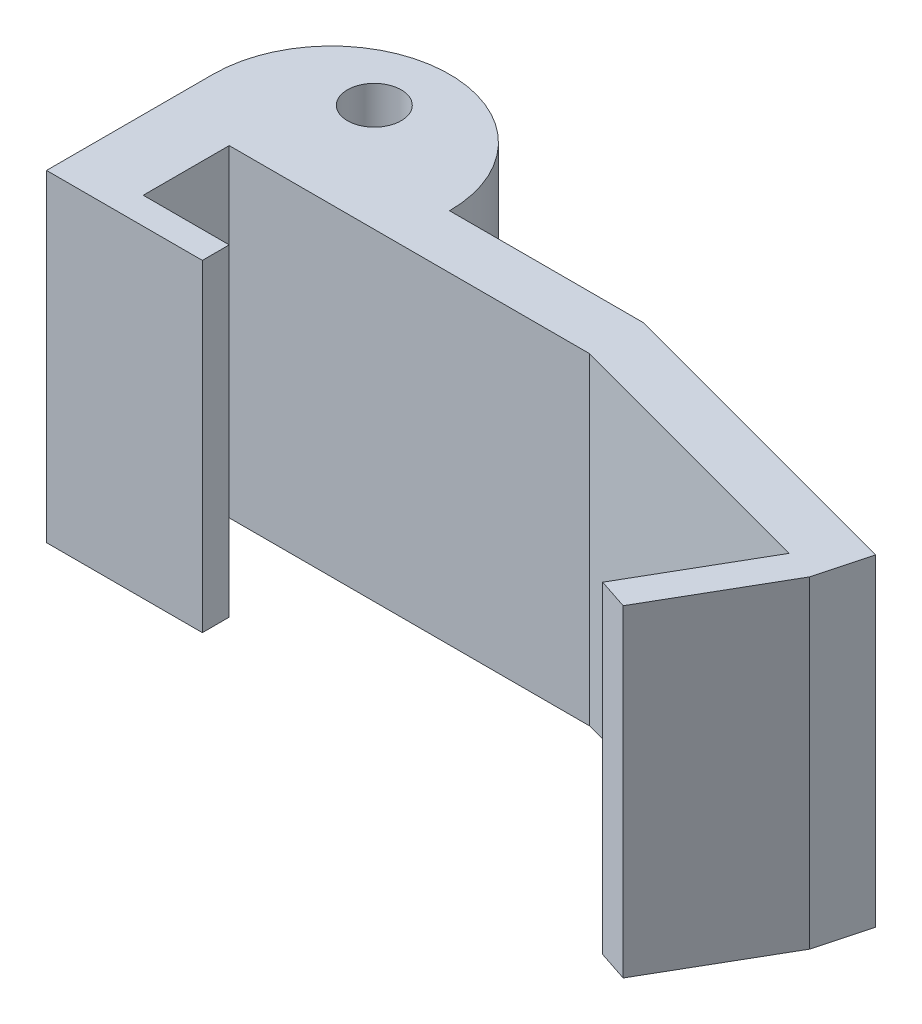
ISO-10303-21;
HEADER;
FILE_DESCRIPTION(('STEP AP214'),'2;1');
FILE_NAME('part.step','',(''),(''),'','','');
FILE_SCHEMA(('AUTOMOTIVE_DESIGN { 1 0 10303 214 1 1 1 1 }'));
ENDSEC;
DATA;
#1=APPLICATION_CONTEXT('core data for automotive mechanical design processes');
#2=APPLICATION_PROTOCOL_DEFINITION('international standard','automotive_design',2000,#1);
#3=PRODUCT_CONTEXT('',#1,'mechanical');
#4=PRODUCT('Part','Part','',(#3));
#5=PRODUCT_RELATED_PRODUCT_CATEGORY('part','',(#4));
#6=PRODUCT_DEFINITION_FORMATION('','',#4);
#7=PRODUCT_DEFINITION_CONTEXT('part definition',#1,'design');
#8=PRODUCT_DEFINITION('design','',#6,#7);
#9=PRODUCT_DEFINITION_SHAPE('','',#8);
#10=(LENGTH_UNIT() NAMED_UNIT(*) SI_UNIT(.MILLI.,.METRE.));
#11=(NAMED_UNIT(*) PLANE_ANGLE_UNIT() SI_UNIT($,.RADIAN.));
#12=(NAMED_UNIT(*) SI_UNIT($,.STERADIAN.) SOLID_ANGLE_UNIT());
#13=UNCERTAINTY_MEASURE_WITH_UNIT(LENGTH_MEASURE(1.E-05),#10,'distance_accuracy_value','');
#14=(GEOMETRIC_REPRESENTATION_CONTEXT(3) GLOBAL_UNCERTAINTY_ASSIGNED_CONTEXT((#13)) GLOBAL_UNIT_ASSIGNED_CONTEXT((#10,
#11,#12)) REPRESENTATION_CONTEXT('',''));
#15=CARTESIAN_POINT('',(0.,0.,0.));
#16=DIRECTION('',(0.,0.,1.));
#17=DIRECTION('',(1.,0.,0.));
#18=AXIS2_PLACEMENT_3D('',#15,#16,#17);
#19=CARTESIAN_POINT('',(2.,6.,-1.));
#20=DIRECTION('',(0.,-1.,0.));
#21=DIRECTION('',(0.,0.,-1.));
#22=AXIS2_PLACEMENT_3D('',#19,#20,#21);
#23=CYLINDRICAL_SURFACE('',#22,0.5);
#24=CARTESIAN_POINT('',(2.,6.,-1.));
#25=DIRECTION('',(0.,1.,0.));
#26=DIRECTION('',(0.,0.,1.));
#27=AXIS2_PLACEMENT_3D('',#24,#25,#26);
#28=CIRCLE('',#27,0.5);
#29=CARTESIAN_POINT('',(2.,6.,-0.5));
#30=VERTEX_POINT('',#29);
#31=EDGE_CURVE('E179',#30,#30,#28,.T.);
#32=ORIENTED_EDGE('',*,*,#31,.T.);
#33=EDGE_LOOP('',(#32));
#34=FACE_BOUND('',#33,.T.);
#35=CARTESIAN_POINT('',(2.,0.,-1.));
#36=DIRECTION('',(0.,1.,0.));
#37=DIRECTION('',(0.,0.,1.));
#38=AXIS2_PLACEMENT_3D('',#35,#36,#37);
#39=CIRCLE('',#38,0.5);
#40=CARTESIAN_POINT('',(2.,0.,-0.5));
#41=VERTEX_POINT('',#40);
#42=EDGE_CURVE('E180',#41,#41,#39,.T.);
#43=ORIENTED_EDGE('',*,*,#42,.F.);
#44=EDGE_LOOP('',(#43));
#45=FACE_BOUND('',#44,.T.);
#46=ADVANCED_FACE('F85',(#34,#45),#23,.F.);
#47=CARTESIAN_POINT('',(0.,6.,0.));
#48=DIRECTION('',(0.,0.,1.));
#49=DIRECTION('',(1.,0.,0.));
#50=AXIS2_PLACEMENT_3D('',#47,#48,#49);
#51=PLANE('',#50);
#52=DIRECTION('',(-1.,0.,0.));
#53=VECTOR('',#52,1.);
#54=CARTESIAN_POINT('',(0.,0.,0.));
#55=LINE('',#54,#53);
#56=CARTESIAN_POINT('',(8.,0.,0.));
#57=VERTEX_POINT('',#56);
#58=CARTESIAN_POINT('',(4.4,0.,0.));
#59=VERTEX_POINT('',#58);
#60=EDGE_CURVE('E210',#57,#59,#55,.T.);
#61=ORIENTED_EDGE('',*,*,#60,.T.);
#62=DIRECTION('',(0.,-1.,0.));
#63=VECTOR('',#62,1.);
#64=CARTESIAN_POINT('',(4.4,6.,0.));
#65=LINE('',#64,#63);
#66=CARTESIAN_POINT('',(4.4,6.,0.));
#67=VERTEX_POINT('',#66);
#68=EDGE_CURVE('E150',#67,#59,#65,.T.);
#69=ORIENTED_EDGE('',*,*,#68,.F.);
#70=DIRECTION('',(-1.,0.,0.));
#71=VECTOR('',#70,1.);
#72=CARTESIAN_POINT('',(0.,6.,0.));
#73=LINE('',#72,#71);
#74=CARTESIAN_POINT('',(8.,6.,0.));
#75=VERTEX_POINT('',#74);
#76=EDGE_CURVE('E246',#75,#67,#73,.T.);
#77=ORIENTED_EDGE('',*,*,#76,.F.);
#78=DIRECTION('',(0.,-1.,0.));
#79=VECTOR('',#78,1.);
#80=CARTESIAN_POINT('',(8.,6.,0.));
#81=LINE('',#80,#79);
#82=EDGE_CURVE('E95',#75,#57,#81,.T.);
#83=ORIENTED_EDGE('',*,*,#82,.T.);
#84=EDGE_LOOP('',(#61,#69,#77,#83));
#85=FACE_BOUND('',#84,.T.);
#86=ADVANCED_FACE('F329',(#85),#51,.F.);
#87=CARTESIAN_POINT('',(2.2,6.,0.));
#88=DIRECTION('',(0.,-1.,0.));
#89=DIRECTION('',(0.,0.,-1.));
#90=AXIS2_PLACEMENT_3D('',#87,#88,#89);
#91=CYLINDRICAL_SURFACE('',#90,2.2);
#92=CARTESIAN_POINT('',(2.2,0.,0.));
#93=DIRECTION('',(0.,1.,0.));
#94=DIRECTION('',(0.,0.,1.));
#95=AXIS2_PLACEMENT_3D('',#92,#93,#94);
#96=CIRCLE('',#95,2.2);
#97=CARTESIAN_POINT('',(0.,0.,0.));
#98=VERTEX_POINT('',#97);
#99=EDGE_CURVE('E207',#98,#59,#96,.F.);
#100=ORIENTED_EDGE('',*,*,#99,.F.);
#101=DIRECTION('',(0.,-1.,0.));
#102=VECTOR('',#101,1.);
#103=CARTESIAN_POINT('',(0.,6.,0.));
#104=LINE('',#103,#102);
#105=CARTESIAN_POINT('',(0.,6.,0.));
#106=VERTEX_POINT('',#105);
#107=EDGE_CURVE('E153',#106,#98,#104,.T.);
#108=ORIENTED_EDGE('',*,*,#107,.F.);
#109=CARTESIAN_POINT('',(2.2,6.,0.));
#110=DIRECTION('',(0.,1.,0.));
#111=DIRECTION('',(0.,0.,1.));
#112=AXIS2_PLACEMENT_3D('',#109,#110,#111);
#113=CIRCLE('',#112,2.2);
#114=EDGE_CURVE('E243',#106,#67,#113,.F.);
#115=ORIENTED_EDGE('',*,*,#114,.T.);
#116=ORIENTED_EDGE('',*,*,#68,.T.);
#117=EDGE_LOOP('',(#100,#108,#115,#116));
#118=FACE_BOUND('',#117,.T.);
#119=ADVANCED_FACE('F334',(#118),#91,.T.);
#120=CARTESIAN_POINT('',(0.,6.,0.));
#121=DIRECTION('',(1.,0.,0.));
#122=DIRECTION('',(0.,0.,-1.));
#123=AXIS2_PLACEMENT_3D('',#120,#121,#122);
#124=PLANE('',#123);
#125=DIRECTION('',(0.,0.,1.));
#126=VECTOR('',#125,1.);
#127=CARTESIAN_POINT('',(0.,0.,0.));
#128=LINE('',#127,#126);
#129=CARTESIAN_POINT('',(0.,0.,3.1));
#130=VERTEX_POINT('',#129);
#131=EDGE_CURVE('E204',#98,#130,#128,.T.);
#132=ORIENTED_EDGE('',*,*,#131,.T.);
#133=DIRECTION('',(0.,-1.,0.));
#134=VECTOR('',#133,1.);
#135=CARTESIAN_POINT('',(0.,6.,3.1));
#136=LINE('',#135,#134);
#137=CARTESIAN_POINT('',(0.,6.,3.1));
#138=VERTEX_POINT('',#137);
#139=EDGE_CURVE('E156',#138,#130,#136,.T.);
#140=ORIENTED_EDGE('',*,*,#139,.F.);
#141=DIRECTION('',(0.,0.,1.));
#142=VECTOR('',#141,1.);
#143=CARTESIAN_POINT('',(0.,6.,0.));
#144=LINE('',#143,#142);
#145=EDGE_CURVE('E240',#106,#138,#144,.T.);
#146=ORIENTED_EDGE('',*,*,#145,.F.);
#147=ORIENTED_EDGE('',*,*,#107,.T.);
#148=EDGE_LOOP('',(#132,#140,#146,#147));
#149=FACE_BOUND('',#148,.T.);
#150=ADVANCED_FACE('F336',(#149),#124,.F.);
#151=CARTESIAN_POINT('',(0.,6.,3.1));
#152=DIRECTION('',(0.,0.,-1.));
#153=DIRECTION('',(-1.,0.,0.));
#154=AXIS2_PLACEMENT_3D('',#151,#152,#153);
#155=PLANE('',#154);
#156=DIRECTION('',(1.,0.,0.));
#157=VECTOR('',#156,1.);
#158=CARTESIAN_POINT('',(0.,0.,3.1));
#159=LINE('',#158,#157);
#160=CARTESIAN_POINT('',(2.9,0.,3.1));
#161=VERTEX_POINT('',#160);
#162=EDGE_CURVE('E120',#130,#161,#159,.T.);
#163=ORIENTED_EDGE('',*,*,#162,.T.);
#164=DIRECTION('',(0.,-1.,0.));
#165=VECTOR('',#164,1.);
#166=CARTESIAN_POINT('',(2.9,6.,3.1));
#167=LINE('',#166,#165);
#168=CARTESIAN_POINT('',(2.9,6.,3.1));
#169=VERTEX_POINT('',#168);
#170=EDGE_CURVE('E89',#169,#161,#167,.T.);
#171=ORIENTED_EDGE('',*,*,#170,.F.);
#172=DIRECTION('',(1.,0.,0.));
#173=VECTOR('',#172,1.);
#174=CARTESIAN_POINT('',(0.,6.,3.1));
#175=LINE('',#174,#173);
#176=EDGE_CURVE('E238',#138,#169,#175,.T.);
#177=ORIENTED_EDGE('',*,*,#176,.F.);
#178=ORIENTED_EDGE('',*,*,#139,.T.);
#179=EDGE_LOOP('',(#163,#171,#177,#178));
#180=FACE_BOUND('',#179,.T.);
#181=ADVANCED_FACE('F338',(#180),#155,.F.);
#182=CARTESIAN_POINT('',(1.3,6.,0.));
#183=DIRECTION('',(1.,0.,0.));
#184=DIRECTION('',(0.,0.,-1.));
#185=AXIS2_PLACEMENT_3D('',#182,#183,#184);
#186=PLANE('',#185);
#187=DIRECTION('',(0.,1.,0.));
#188=VECTOR('',#187,1.);
#189=CARTESIAN_POINT('',(1.3,6.,2.6));
#190=LINE('',#189,#188);
#191=CARTESIAN_POINT('',(1.3,0.,2.6));
#192=VERTEX_POINT('',#191);
#193=CARTESIAN_POINT('',(1.3,6.,2.6));
#194=VERTEX_POINT('',#193);
#195=EDGE_CURVE('E12',#192,#194,#190,.T.);
#196=ORIENTED_EDGE('',*,*,#195,.F.);
#197=DIRECTION('',(0.,0.,1.));
#198=VECTOR('',#197,1.);
#199=CARTESIAN_POINT('',(1.3,0.,0.));
#200=LINE('',#199,#198);
#201=CARTESIAN_POINT('',(1.3,0.,1.));
#202=VERTEX_POINT('',#201);
#203=EDGE_CURVE('E142',#202,#192,#200,.T.);
#204=ORIENTED_EDGE('',*,*,#203,.F.);
#205=DIRECTION('',(0.,-1.,0.));
#206=VECTOR('',#205,1.);
#207=CARTESIAN_POINT('',(1.3,6.,1.));
#208=LINE('',#207,#206);
#209=CARTESIAN_POINT('',(1.3,6.,1.));
#210=VERTEX_POINT('',#209);
#211=EDGE_CURVE('E158',#210,#202,#208,.T.);
#212=ORIENTED_EDGE('',*,*,#211,.F.);
#213=DIRECTION('',(0.,0.,1.));
#214=VECTOR('',#213,1.);
#215=CARTESIAN_POINT('',(1.3,6.,0.));
#216=LINE('',#215,#214);
#217=EDGE_CURVE('E235',#210,#194,#216,.T.);
#218=ORIENTED_EDGE('',*,*,#217,.T.);
#219=EDGE_LOOP('',(#196,#204,#212,#218));
#220=FACE_BOUND('',#219,.T.);
#221=ADVANCED_FACE('F341',(#220),#186,.T.);
#222=CARTESIAN_POINT('',(0.,6.,1.00000000000001));
#223=DIRECTION('',(0.,0.,-1.));
#224=DIRECTION('',(-1.,0.,0.));
#225=AXIS2_PLACEMENT_3D('',#222,#223,#224);
#226=PLANE('',#225);
#227=DIRECTION('',(1.,0.,0.));
#228=VECTOR('',#227,1.);
#229=CARTESIAN_POINT('',(0.,0.,1.00000000000001));
#230=LINE('',#229,#228);
#231=CARTESIAN_POINT('',(8.,0.,1.));
#232=VERTEX_POINT('',#231);
#233=EDGE_CURVE('E199',#202,#232,#230,.T.);
#234=ORIENTED_EDGE('',*,*,#233,.T.);
#235=DIRECTION('',(0.,-1.,0.));
#236=VECTOR('',#235,1.);
#237=CARTESIAN_POINT('',(8.,6.,1.));
#238=LINE('',#237,#236);
#239=CARTESIAN_POINT('',(8.,6.,1.));
#240=VERTEX_POINT('',#239);
#241=EDGE_CURVE('E161',#240,#232,#238,.T.);
#242=ORIENTED_EDGE('',*,*,#241,.F.);
#243=DIRECTION('',(1.,0.,0.));
#244=VECTOR('',#243,1.);
#245=CARTESIAN_POINT('',(0.,6.,1.00000000000001));
#246=LINE('',#245,#244);
#247=EDGE_CURVE('E232',#210,#240,#246,.T.);
#248=ORIENTED_EDGE('',*,*,#247,.F.);
#249=ORIENTED_EDGE('',*,*,#211,.T.);
#250=EDGE_LOOP('',(#234,#242,#248,#249));
#251=FACE_BOUND('',#250,.T.);
#252=ADVANCED_FACE('F345',(#251),#226,.F.);
#253=CARTESIAN_POINT('',(0.285898384862224,6.,-1.06698729810773));
#254=DIRECTION('',(-0.258819045102514,0.,0.96592582628907));
#255=DIRECTION('',(0.96592582628907,0.,0.258819045102514));
#256=AXIS2_PLACEMENT_3D('',#253,#254,#255);
#257=PLANE('',#256);
#258=DIRECTION('',(-0.96592582628907,0.,-0.258819045102514));
#259=VECTOR('',#258,1.);
#260=CARTESIAN_POINT('',(0.285898384862224,0.,-1.06698729810773));
#261=LINE('',#260,#259);
#262=CARTESIAN_POINT('',(13.0815254692647,0.,2.36159064580763));
#263=VERTEX_POINT('',#262);
#264=EDGE_CURVE('E196',#263,#232,#261,.T.);
#265=ORIENTED_EDGE('',*,*,#264,.F.);
#266=DIRECTION('',(0.,-1.,0.));
#267=VECTOR('',#266,1.);
#268=CARTESIAN_POINT('',(13.0815254692647,6.,2.36159064580763));
#269=LINE('',#268,#267);
#270=CARTESIAN_POINT('',(13.0815254692647,6.,2.36159064580763));
#271=VERTEX_POINT('',#270);
#272=EDGE_CURVE('E164',#271,#263,#269,.T.);
#273=ORIENTED_EDGE('',*,*,#272,.F.);
#274=DIRECTION('',(-0.96592582628907,0.,-0.258819045102514));
#275=VECTOR('',#274,1.);
#276=CARTESIAN_POINT('',(0.285898384862224,6.,-1.06698729810773));
#277=LINE('',#276,#275);
#278=EDGE_CURVE('E229',#271,#240,#277,.T.);
#279=ORIENTED_EDGE('',*,*,#278,.T.);
#280=ORIENTED_EDGE('',*,*,#241,.T.);
#281=EDGE_LOOP('',(#265,#273,#279,#280));
#282=FACE_BOUND('',#281,.T.);
#283=ADVANCED_FACE('F348',(#282),#257,.T.);
#284=CARTESIAN_POINT('',(10.8337428482534,6.,6.25486434976988));
#285=DIRECTION('',(0.866025403784452,0.,0.499999999999977));
#286=DIRECTION('',(0.499999999999977,0.,-0.866025403784452));
#287=AXIS2_PLACEMENT_3D('',#284,#285,#286);
#288=PLANE('',#287);
#289=DIRECTION('',(-0.499999999999977,0.,0.866025403784452));
#290=VECTOR('',#289,1.);
#291=CARTESIAN_POINT('',(10.8337428482534,0.,6.25486434976988));
#292=LINE('',#291,#290);
#293=CARTESIAN_POINT('',(11.8113548770476,0.,4.56159064580763));
#294=VERTEX_POINT('',#293);
#295=EDGE_CURVE('E193',#263,#294,#292,.T.);
#296=ORIENTED_EDGE('',*,*,#295,.T.);
#297=DIRECTION('',(0.,-1.,0.));
#298=VECTOR('',#297,1.);
#299=CARTESIAN_POINT('',(11.8113548770476,6.,4.56159064580763));
#300=LINE('',#299,#298);
#301=CARTESIAN_POINT('',(11.8113548770476,6.,4.56159064580763));
#302=VERTEX_POINT('',#301);
#303=EDGE_CURVE('E167',#302,#294,#300,.T.);
#304=ORIENTED_EDGE('',*,*,#303,.F.);
#305=DIRECTION('',(-0.499999999999977,0.,0.866025403784452));
#306=VECTOR('',#305,1.);
#307=CARTESIAN_POINT('',(10.8337428482534,6.,6.25486434976988));
#308=LINE('',#307,#306);
#309=EDGE_CURVE('E226',#271,#302,#308,.T.);
#310=ORIENTED_EDGE('',*,*,#309,.F.);
#311=ORIENTED_EDGE('',*,*,#272,.T.);
#312=EDGE_LOOP('',(#296,#304,#310,#311));
#313=FACE_BOUND('',#312,.T.);
#314=ADVANCED_FACE('F318',(#313),#288,.F.);
#315=CARTESIAN_POINT('',(-0.19798278282436,6.,0.600204588905477));
#316=DIRECTION('',(-0.313256551936076,0.,0.949668538316986));
#317=DIRECTION('',(0.949668538316986,0.,0.313256551936076));
#318=AXIS2_PLACEMENT_3D('',#315,#316,#317);
#319=PLANE('',#318);
#320=DIRECTION('',(-0.949668538316986,0.,-0.313256551936076));
#321=VECTOR('',#320,1.);
#322=CARTESIAN_POINT('',(-0.19798278282436,0.,0.600204588905477));
#323=LINE('',#322,#321);
#324=CARTESIAN_POINT('',(12.3811560000378,0.,4.74954457696928));
#325=VERTEX_POINT('',#324);
#326=EDGE_CURVE('E190',#325,#294,#323,.T.);
#327=ORIENTED_EDGE('',*,*,#326,.F.);
#328=DIRECTION('',(0.,-1.,0.));
#329=VECTOR('',#328,1.);
#330=CARTESIAN_POINT('',(12.3811560000378,6.,4.74954457696928));
#331=LINE('',#330,#329);
#332=CARTESIAN_POINT('',(12.3811560000378,6.,4.74954457696928));
#333=VERTEX_POINT('',#332);
#334=EDGE_CURVE('E170',#333,#325,#331,.T.);
#335=ORIENTED_EDGE('',*,*,#334,.F.);
#336=DIRECTION('',(-0.949668538316986,0.,-0.313256551936076));
#337=VECTOR('',#336,1.);
#338=CARTESIAN_POINT('',(-0.19798278282436,6.,0.600204588905477));
#339=LINE('',#338,#337);
#340=EDGE_CURVE('E223',#333,#302,#339,.T.);
#341=ORIENTED_EDGE('',*,*,#340,.T.);
#342=ORIENTED_EDGE('',*,*,#303,.T.);
#343=EDGE_LOOP('',(#327,#335,#341,#342));
#344=FACE_BOUND('',#343,.T.);
#345=ADVANCED_FACE('F322',(#344),#319,.T.);
#346=CARTESIAN_POINT('',(11.3424801300596,6.,6.54858395636749));
#347=DIRECTION('',(0.866025403784451,0.,0.499999999999978));
#348=DIRECTION('',(0.499999999999978,0.,-0.866025403784452));
#349=AXIS2_PLACEMENT_3D('',#346,#347,#348);
#350=PLANE('',#349);
#351=DIRECTION('',(-0.499999999999978,0.,0.866025403784452));
#352=VECTOR('',#351,1.);
#353=CARTESIAN_POINT('',(11.3424801300596,0.,6.54858395636749));
#354=LINE('',#353,#352);
#355=CARTESIAN_POINT('',(13.6513265922549,0.,2.54954457696928));
#356=VERTEX_POINT('',#355);
#357=EDGE_CURVE('E187',#356,#325,#354,.T.);
#358=ORIENTED_EDGE('',*,*,#357,.F.);
#359=DIRECTION('',(0.,-1.,0.));
#360=VECTOR('',#359,1.);
#361=CARTESIAN_POINT('',(13.6513265922549,6.,2.54954457696928));
#362=LINE('',#361,#360);
#363=CARTESIAN_POINT('',(13.6513265922549,6.,2.54954457696928));
#364=VERTEX_POINT('',#363);
#365=EDGE_CURVE('E173',#364,#356,#362,.T.);
#366=ORIENTED_EDGE('',*,*,#365,.F.);
#367=DIRECTION('',(-0.499999999999978,0.,0.866025403784452));
#368=VECTOR('',#367,1.);
#369=CARTESIAN_POINT('',(11.3424801300596,6.,6.54858395636749));
#370=LINE('',#369,#368);
#371=EDGE_CURVE('E220',#364,#333,#370,.T.);
#372=ORIENTED_EDGE('',*,*,#371,.T.);
#373=ORIENTED_EDGE('',*,*,#334,.T.);
#374=EDGE_LOOP('',(#358,#366,#372,#373));
#375=FACE_BOUND('',#374,.T.);
#376=ADVANCED_FACE('F323',(#375),#350,.T.);
#377=CARTESIAN_POINT('',(13.3742472524952,6.,3.58361875068017));
#378=DIRECTION('',(0.96592582628907,0.,0.258819045102516));
#379=DIRECTION('',(0.258819045102516,0.,-0.96592582628907));
#380=AXIS2_PLACEMENT_3D('',#377,#378,#379);
#381=PLANE('',#380);
#382=DIRECTION('',(-0.258819045102516,0.,0.96592582628907));
#383=VECTOR('',#382,1.);
#384=CARTESIAN_POINT('',(13.3742472524952,0.,3.58361875068017));
#385=LINE('',#384,#383);
#386=CARTESIAN_POINT('',(13.9101456373574,0.,1.5836187506802));
#387=VERTEX_POINT('',#386);
#388=EDGE_CURVE('E184',#387,#356,#385,.T.);
#389=ORIENTED_EDGE('',*,*,#388,.F.);
#390=DIRECTION('',(0.,-1.,0.));
#391=VECTOR('',#390,1.);
#392=CARTESIAN_POINT('',(13.9101456373574,6.,1.5836187506802));
#393=LINE('',#392,#391);
#394=CARTESIAN_POINT('',(13.9101456373574,6.,1.5836187506802));
#395=VERTEX_POINT('',#394);
#396=EDGE_CURVE('E176',#395,#387,#393,.T.);
#397=ORIENTED_EDGE('',*,*,#396,.F.);
#398=DIRECTION('',(-0.258819045102516,0.,0.96592582628907));
#399=VECTOR('',#398,1.);
#400=CARTESIAN_POINT('',(13.3742472524952,6.,3.58361875068017));
#401=LINE('',#400,#399);
#402=EDGE_CURVE('E217',#395,#364,#401,.T.);
#403=ORIENTED_EDGE('',*,*,#402,.T.);
#404=ORIENTED_EDGE('',*,*,#365,.T.);
#405=EDGE_LOOP('',(#389,#397,#403,#404));
#406=FACE_BOUND('',#405,.T.);
#407=ADVANCED_FACE('F269',(#406),#381,.T.);
#408=CARTESIAN_POINT('',(0.535898384862218,6.,-1.99999999999995));
#409=DIRECTION('',(0.258819045102514,0.,-0.96592582628907));
#410=DIRECTION('',(-0.96592582628907,0.,-0.258819045102514));
#411=AXIS2_PLACEMENT_3D('',#408,#409,#410);
#412=PLANE('',#411);
#413=DIRECTION('',(0.96592582628907,0.,0.258819045102514));
#414=VECTOR('',#413,1.);
#415=CARTESIAN_POINT('',(0.535898384862218,0.,-1.99999999999995));
#416=LINE('',#415,#414);
#417=EDGE_CURVE('E213',#57,#387,#416,.T.);
#418=ORIENTED_EDGE('',*,*,#417,.F.);
#419=ORIENTED_EDGE('',*,*,#82,.F.);
#420=DIRECTION('',(0.96592582628907,0.,0.258819045102514));
#421=VECTOR('',#420,1.);
#422=CARTESIAN_POINT('',(0.535898384862218,6.,-1.99999999999995));
#423=LINE('',#422,#421);
#424=EDGE_CURVE('E183',#75,#395,#423,.T.);
#425=ORIENTED_EDGE('',*,*,#424,.T.);
#426=ORIENTED_EDGE('',*,*,#396,.T.);
#427=EDGE_LOOP('',(#418,#419,#425,#426));
#428=FACE_BOUND('',#427,.T.);
#429=ADVANCED_FACE('F255',(#428),#412,.T.);
#430=CARTESIAN_POINT('',(0.,0.,0.));
#431=DIRECTION('',(0.,1.,0.));
#432=DIRECTION('',(0.,0.,1.));
#433=AXIS2_PLACEMENT_3D('',#430,#431,#432);
#434=PLANE('',#433);
#435=ORIENTED_EDGE('',*,*,#417,.T.);
#436=ORIENTED_EDGE('',*,*,#388,.T.);
#437=ORIENTED_EDGE('',*,*,#357,.T.);
#438=ORIENTED_EDGE('',*,*,#326,.T.);
#439=ORIENTED_EDGE('',*,*,#295,.F.);
#440=ORIENTED_EDGE('',*,*,#264,.T.);
#441=ORIENTED_EDGE('',*,*,#233,.F.);
#442=ORIENTED_EDGE('',*,*,#203,.T.);
#443=DIRECTION('',(1.,0.,0.));
#444=VECTOR('',#443,1.);
#445=CARTESIAN_POINT('',(1.3,0.,2.6));
#446=LINE('',#445,#444);
#447=CARTESIAN_POINT('',(2.9,0.,2.6));
#448=VERTEX_POINT('',#447);
#449=EDGE_CURVE('E128',#192,#448,#446,.T.);
#450=ORIENTED_EDGE('',*,*,#449,.T.);
#451=DIRECTION('',(0.,0.,-1.));
#452=VECTOR('',#451,1.);
#453=CARTESIAN_POINT('',(2.9,0.,3.1));
#454=LINE('',#453,#452);
#455=EDGE_CURVE('E134',#161,#448,#454,.T.);
#456=ORIENTED_EDGE('',*,*,#455,.F.);
#457=ORIENTED_EDGE('',*,*,#162,.F.);
#458=ORIENTED_EDGE('',*,*,#131,.F.);
#459=ORIENTED_EDGE('',*,*,#99,.T.);
#460=ORIENTED_EDGE('',*,*,#60,.F.);
#461=EDGE_LOOP('',(#435,#436,#437,#438,#439,#440,#441,#442,#450,#456,#457,#458,#459,#460));
#462=FACE_BOUND('',#461,.T.);
#463=ORIENTED_EDGE('',*,*,#42,.T.);
#464=EDGE_LOOP('',(#463));
#465=FACE_BOUND('',#464,.T.);
#466=ADVANCED_FACE('F138',(#462,#465),#434,.F.);
#467=CARTESIAN_POINT('',(0.,6.,0.));
#468=DIRECTION('',(0.,1.,0.));
#469=DIRECTION('',(0.,0.,1.));
#470=AXIS2_PLACEMENT_3D('',#467,#468,#469);
#471=PLANE('',#470);
#472=ORIENTED_EDGE('',*,*,#424,.F.);
#473=ORIENTED_EDGE('',*,*,#76,.T.);
#474=ORIENTED_EDGE('',*,*,#114,.F.);
#475=ORIENTED_EDGE('',*,*,#145,.T.);
#476=ORIENTED_EDGE('',*,*,#176,.T.);
#477=DIRECTION('',(0.,0.,-1.));
#478=VECTOR('',#477,1.);
#479=CARTESIAN_POINT('',(2.9,6.,3.1));
#480=LINE('',#479,#478);
#481=CARTESIAN_POINT('',(2.9,6.,2.6));
#482=VERTEX_POINT('',#481);
#483=EDGE_CURVE('E143',#169,#482,#480,.T.);
#484=ORIENTED_EDGE('',*,*,#483,.T.);
#485=DIRECTION('',(1.,0.,0.));
#486=VECTOR('',#485,1.);
#487=CARTESIAN_POINT('',(1.3,6.,2.6));
#488=LINE('',#487,#486);
#489=EDGE_CURVE('E130',#194,#482,#488,.T.);
#490=ORIENTED_EDGE('',*,*,#489,.F.);
#491=ORIENTED_EDGE('',*,*,#217,.F.);
#492=ORIENTED_EDGE('',*,*,#247,.T.);
#493=ORIENTED_EDGE('',*,*,#278,.F.);
#494=ORIENTED_EDGE('',*,*,#309,.T.);
#495=ORIENTED_EDGE('',*,*,#340,.F.);
#496=ORIENTED_EDGE('',*,*,#371,.F.);
#497=ORIENTED_EDGE('',*,*,#402,.F.);
#498=EDGE_LOOP('',(#472,#473,#474,#475,#476,#484,#490,#491,#492,#493,#494,#495,#496,#497));
#499=FACE_BOUND('',#498,.T.);
#500=ORIENTED_EDGE('',*,*,#31,.F.);
#501=EDGE_LOOP('',(#500));
#502=FACE_BOUND('',#501,.T.);
#503=ADVANCED_FACE('F264',(#499,#502),#471,.T.);
#504=CARTESIAN_POINT('',(2.9,6.,3.1));
#505=DIRECTION('',(-1.,0.,0.));
#506=DIRECTION('',(0.,0.,1.));
#507=AXIS2_PLACEMENT_3D('',#504,#505,#506);
#508=PLANE('',#507);
#509=ORIENTED_EDGE('',*,*,#455,.T.);
#510=DIRECTION('',(0.,-1.,0.));
#511=VECTOR('',#510,1.);
#512=CARTESIAN_POINT('',(2.9,6.,2.6));
#513=LINE('',#512,#511);
#514=EDGE_CURVE('E124',#482,#448,#513,.T.);
#515=ORIENTED_EDGE('',*,*,#514,.F.);
#516=ORIENTED_EDGE('',*,*,#483,.F.);
#517=ORIENTED_EDGE('',*,*,#170,.T.);
#518=EDGE_LOOP('',(#509,#515,#516,#517));
#519=FACE_BOUND('',#518,.T.);
#520=ADVANCED_FACE('F87',(#519),#508,.F.);
#521=CARTESIAN_POINT('',(1.3,6.,2.6));
#522=DIRECTION('',(0.,0.,-1.));
#523=DIRECTION('',(-1.,0.,0.));
#524=AXIS2_PLACEMENT_3D('',#521,#522,#523);
#525=PLANE('',#524);
#526=ORIENTED_EDGE('',*,*,#449,.F.);
#527=ORIENTED_EDGE('',*,*,#195,.T.);
#528=ORIENTED_EDGE('',*,*,#489,.T.);
#529=ORIENTED_EDGE('',*,*,#514,.T.);
#530=EDGE_LOOP('',(#526,#527,#528,#529));
#531=FACE_BOUND('',#530,.T.);
#532=ADVANCED_FACE('F126',(#531),#525,.T.);
#533=CLOSED_SHELL('',(#46,#86,#119,#150,#181,#221,#252,#283,#314,#345,#376,#407,#429,#466,#503,
#520,#532));
#534=MANIFOLD_SOLID_BREP('B2',#533);
#535=ADVANCED_BREP_SHAPE_REPRESENTATION('',(#18,#534),#14);
#536=SHAPE_DEFINITION_REPRESENTATION(#9,#535);
ENDSEC;
END-ISO-10303-21;
